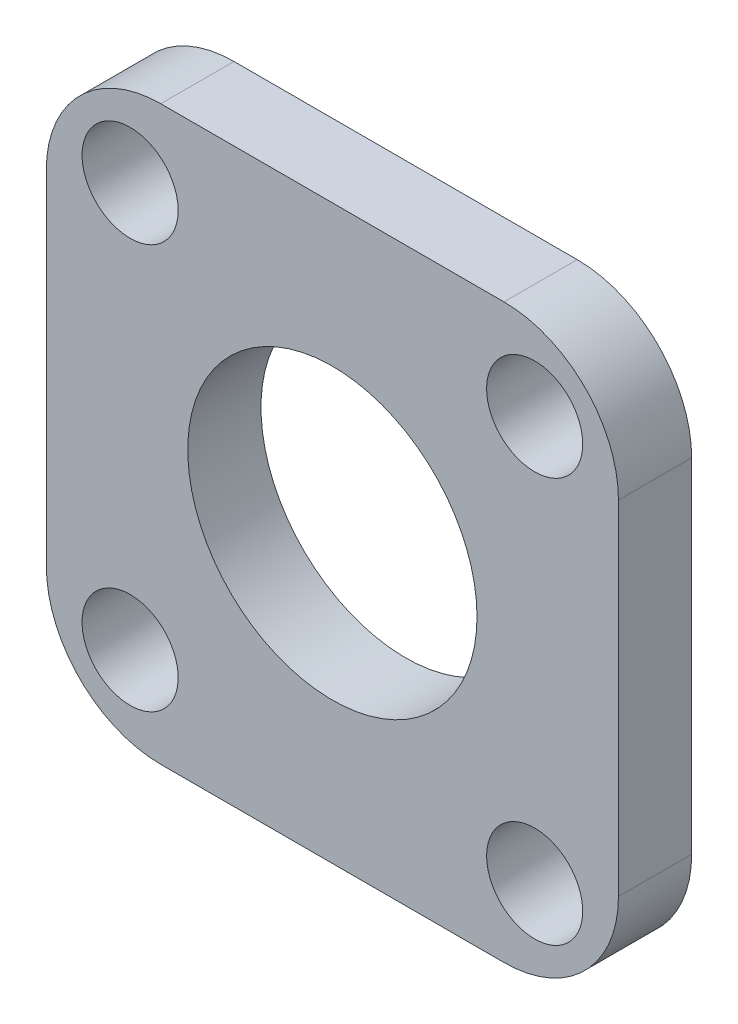
ISO-10303-21;
HEADER;
FILE_DESCRIPTION(('STEP AP214'),'2;1');
FILE_NAME('part.step','',(''),(''),'','','');
FILE_SCHEMA(('AUTOMOTIVE_DESIGN { 1 0 10303 214 1 1 1 1 }'));
ENDSEC;
DATA;
#1=APPLICATION_CONTEXT('core data for automotive mechanical design processes');
#2=APPLICATION_PROTOCOL_DEFINITION('international standard','automotive_design',2000,#1);
#3=PRODUCT_CONTEXT('',#1,'mechanical');
#4=PRODUCT('Part','Part','',(#3));
#5=PRODUCT_RELATED_PRODUCT_CATEGORY('part','',(#4));
#6=PRODUCT_DEFINITION_FORMATION('','',#4);
#7=PRODUCT_DEFINITION_CONTEXT('part definition',#1,'design');
#8=PRODUCT_DEFINITION('design','',#6,#7);
#9=PRODUCT_DEFINITION_SHAPE('','',#8);
#10=(LENGTH_UNIT() NAMED_UNIT(*) SI_UNIT(.MILLI.,.METRE.));
#11=(NAMED_UNIT(*) PLANE_ANGLE_UNIT() SI_UNIT($,.RADIAN.));
#12=(NAMED_UNIT(*) SI_UNIT($,.STERADIAN.) SOLID_ANGLE_UNIT());
#13=UNCERTAINTY_MEASURE_WITH_UNIT(LENGTH_MEASURE(1.E-05),#10,'distance_accuracy_value','');
#14=(GEOMETRIC_REPRESENTATION_CONTEXT(3) GLOBAL_UNCERTAINTY_ASSIGNED_CONTEXT((#13)) GLOBAL_UNIT_ASSIGNED_CONTEXT((#10,
#11,#12)) REPRESENTATION_CONTEXT('',''));
#15=CARTESIAN_POINT('',(0.,0.,0.));
#16=DIRECTION('',(0.,0.,1.));
#17=DIRECTION('',(1.,0.,0.));
#18=AXIS2_PLACEMENT_3D('',#15,#16,#17);
#19=CARTESIAN_POINT('',(12.5,12.5,3.2));
#20=DIRECTION('',(-1.,0.,0.));
#21=DIRECTION('',(0.,-1.,0.));
#22=AXIS2_PLACEMENT_3D('',#19,#20,#21);
#23=PLANE('',#22);
#24=DIRECTION('',(0.,1.,0.));
#25=VECTOR('',#24,1.);
#26=CARTESIAN_POINT('',(12.5,12.5,3.2));
#27=LINE('',#26,#25);
#28=CARTESIAN_POINT('',(12.5,-7.5,3.2));
#29=VERTEX_POINT('',#28);
#30=CARTESIAN_POINT('',(12.5,7.5,3.2));
#31=VERTEX_POINT('',#30);
#32=EDGE_CURVE('E127',#29,#31,#27,.T.);
#33=ORIENTED_EDGE('',*,*,#32,.F.);
#34=DIRECTION('',(0.,0.,-1.));
#35=VECTOR('',#34,1.);
#36=CARTESIAN_POINT('',(12.5,-7.5,3.2));
#37=LINE('',#36,#35);
#38=CARTESIAN_POINT('',(12.5,-7.5,0.));
#39=VERTEX_POINT('',#38);
#40=EDGE_CURVE('E153',#29,#39,#37,.T.);
#41=ORIENTED_EDGE('',*,*,#40,.T.);
#42=DIRECTION('',(0.,1.,0.));
#43=VECTOR('',#42,1.);
#44=CARTESIAN_POINT('',(12.5,12.5,0.));
#45=LINE('',#44,#43);
#46=CARTESIAN_POINT('',(12.5,7.5,0.));
#47=VERTEX_POINT('',#46);
#48=EDGE_CURVE('E159',#39,#47,#45,.T.);
#49=ORIENTED_EDGE('',*,*,#48,.T.);
#50=DIRECTION('',(0.,0.,-1.));
#51=VECTOR('',#50,1.);
#52=CARTESIAN_POINT('',(12.5,7.5,3.2));
#53=LINE('',#52,#51);
#54=EDGE_CURVE('E151',#47,#31,#53,.F.);
#55=ORIENTED_EDGE('',*,*,#54,.T.);
#56=EDGE_LOOP('',(#33,#41,#49,#55));
#57=FACE_BOUND('',#56,.T.);
#58=ADVANCED_FACE('F35',(#57),#23,.F.);
#59=CARTESIAN_POINT('',(-12.5,12.5,3.2));
#60=DIRECTION('',(0.,-1.,0.));
#61=DIRECTION('',(0.,0.,-1.));
#62=AXIS2_PLACEMENT_3D('',#59,#60,#61);
#63=PLANE('',#62);
#64=DIRECTION('',(-1.,0.,0.));
#65=VECTOR('',#64,1.);
#66=CARTESIAN_POINT('',(-12.5,12.5,3.2));
#67=LINE('',#66,#65);
#68=CARTESIAN_POINT('',(7.5,12.5,3.2));
#69=VERTEX_POINT('',#68);
#70=CARTESIAN_POINT('',(-7.5,12.5,3.2));
#71=VERTEX_POINT('',#70);
#72=EDGE_CURVE('E130',#69,#71,#67,.T.);
#73=ORIENTED_EDGE('',*,*,#72,.F.);
#74=DIRECTION('',(0.,0.,-1.));
#75=VECTOR('',#74,1.);
#76=CARTESIAN_POINT('',(7.5,12.5,3.2));
#77=LINE('',#76,#75);
#78=CARTESIAN_POINT('',(7.5,12.5,0.));
#79=VERTEX_POINT('',#78);
#80=EDGE_CURVE('E11',#69,#79,#77,.T.);
#81=ORIENTED_EDGE('',*,*,#80,.T.);
#82=DIRECTION('',(-1.,0.,0.));
#83=VECTOR('',#82,1.);
#84=CARTESIAN_POINT('',(-12.5,12.5,0.));
#85=LINE('',#84,#83);
#86=CARTESIAN_POINT('',(-7.5,12.5,0.));
#87=VERTEX_POINT('',#86);
#88=EDGE_CURVE('E132',#79,#87,#85,.T.);
#89=ORIENTED_EDGE('',*,*,#88,.T.);
#90=DIRECTION('',(0.,0.,-1.));
#91=VECTOR('',#90,1.);
#92=CARTESIAN_POINT('',(-7.5,12.5,3.2));
#93=LINE('',#92,#91);
#94=EDGE_CURVE('E43',#87,#71,#93,.F.);
#95=ORIENTED_EDGE('',*,*,#94,.T.);
#96=EDGE_LOOP('',(#73,#81,#89,#95));
#97=FACE_BOUND('',#96,.T.);
#98=ADVANCED_FACE('F228',(#97),#63,.F.);
#99=CARTESIAN_POINT('',(-12.5,12.5,3.2));
#100=DIRECTION('',(1.,0.,0.));
#101=DIRECTION('',(0.,1.,0.));
#102=AXIS2_PLACEMENT_3D('',#99,#100,#101);
#103=PLANE('',#102);
#104=DIRECTION('',(0.,-1.,0.));
#105=VECTOR('',#104,1.);
#106=CARTESIAN_POINT('',(-12.5,12.5,0.));
#107=LINE('',#106,#105);
#108=CARTESIAN_POINT('',(-12.5,7.5,0.));
#109=VERTEX_POINT('',#108);
#110=CARTESIAN_POINT('',(-12.5,-7.50000000000001,0.));
#111=VERTEX_POINT('',#110);
#112=EDGE_CURVE('E128',#109,#111,#107,.T.);
#113=ORIENTED_EDGE('',*,*,#112,.T.);
#114=DIRECTION('',(0.,0.,-1.));
#115=VECTOR('',#114,1.);
#116=CARTESIAN_POINT('',(-12.5,-7.50000000000001,3.2));
#117=LINE('',#116,#115);
#118=CARTESIAN_POINT('',(-12.5,-7.50000000000001,3.2));
#119=VERTEX_POINT('',#118);
#120=EDGE_CURVE('E106',#111,#119,#117,.F.);
#121=ORIENTED_EDGE('',*,*,#120,.T.);
#122=DIRECTION('',(0.,-1.,0.));
#123=VECTOR('',#122,1.);
#124=CARTESIAN_POINT('',(-12.5,12.5,3.2));
#125=LINE('',#124,#123);
#126=CARTESIAN_POINT('',(-12.5,7.5,3.2));
#127=VERTEX_POINT('',#126);
#128=EDGE_CURVE('E171',#127,#119,#125,.T.);
#129=ORIENTED_EDGE('',*,*,#128,.F.);
#130=DIRECTION('',(0.,0.,-1.));
#131=VECTOR('',#130,1.);
#132=CARTESIAN_POINT('',(-12.5,7.5,3.2));
#133=LINE('',#132,#131);
#134=EDGE_CURVE('E111',#127,#109,#133,.T.);
#135=ORIENTED_EDGE('',*,*,#134,.T.);
#136=EDGE_LOOP('',(#113,#121,#129,#135));
#137=FACE_BOUND('',#136,.T.);
#138=ADVANCED_FACE('F226',(#137),#103,.F.);
#139=CARTESIAN_POINT('',(-12.5,-12.5,3.2));
#140=DIRECTION('',(0.,1.,0.));
#141=DIRECTION('',(0.,0.,1.));
#142=AXIS2_PLACEMENT_3D('',#139,#140,#141);
#143=PLANE('',#142);
#144=DIRECTION('',(1.,0.,0.));
#145=VECTOR('',#144,1.);
#146=CARTESIAN_POINT('',(-12.5,-12.5,3.2));
#147=LINE('',#146,#145);
#148=CARTESIAN_POINT('',(-7.5,-12.5,3.2));
#149=VERTEX_POINT('',#148);
#150=CARTESIAN_POINT('',(7.5,-12.5,3.2));
#151=VERTEX_POINT('',#150);
#152=EDGE_CURVE('E121',#149,#151,#147,.T.);
#153=ORIENTED_EDGE('',*,*,#152,.F.);
#154=DIRECTION('',(0.,0.,-1.));
#155=VECTOR('',#154,1.);
#156=CARTESIAN_POINT('',(-7.5,-12.5,3.2));
#157=LINE('',#156,#155);
#158=CARTESIAN_POINT('',(-7.5,-12.5,0.));
#159=VERTEX_POINT('',#158);
#160=EDGE_CURVE('E105',#149,#159,#157,.T.);
#161=ORIENTED_EDGE('',*,*,#160,.T.);
#162=DIRECTION('',(1.,0.,0.));
#163=VECTOR('',#162,1.);
#164=CARTESIAN_POINT('',(-12.5,-12.5,0.));
#165=LINE('',#164,#163);
#166=CARTESIAN_POINT('',(7.5,-12.5,0.));
#167=VERTEX_POINT('',#166);
#168=EDGE_CURVE('E118',#159,#167,#165,.T.);
#169=ORIENTED_EDGE('',*,*,#168,.T.);
#170=DIRECTION('',(0.,0.,-1.));
#171=VECTOR('',#170,1.);
#172=CARTESIAN_POINT('',(7.5,-12.5,3.2));
#173=LINE('',#172,#171);
#174=EDGE_CURVE('E123',#167,#151,#173,.F.);
#175=ORIENTED_EDGE('',*,*,#174,.T.);
#176=EDGE_LOOP('',(#153,#161,#169,#175));
#177=FACE_BOUND('',#176,.T.);
#178=ADVANCED_FACE('F117',(#177),#143,.F.);
#179=CARTESIAN_POINT('',(0.,0.,3.2));
#180=DIRECTION('',(0.,0.,1.));
#181=DIRECTION('',(1.,0.,0.));
#182=AXIS2_PLACEMENT_3D('',#179,#180,#181);
#183=PLANE('',#182);
#184=CARTESIAN_POINT('',(8.83883476483175,8.83883476483194,3.2));
#185=DIRECTION('',(0.,0.,1.));
#186=DIRECTION('',(0.,-1.,0.));
#187=AXIS2_PLACEMENT_3D('',#184,#185,#186);
#188=CIRCLE('',#187,2.1);
#189=CARTESIAN_POINT('',(8.83883476483177,6.73883476483194,3.2));
#190=VERTEX_POINT('',#189);
#191=EDGE_CURVE('E196',#190,#190,#188,.T.);
#192=ORIENTED_EDGE('',*,*,#191,.F.);
#193=EDGE_LOOP('',(#192));
#194=FACE_BOUND('',#193,.T.);
#195=CARTESIAN_POINT('',(8.83883476483185,-8.83883476483184,3.2));
#196=DIRECTION('',(0.,0.,1.));
#197=DIRECTION('',(-1.,0.,0.));
#198=AXIS2_PLACEMENT_3D('',#195,#196,#197);
#199=CIRCLE('',#198,2.1);
#200=CARTESIAN_POINT('',(6.73883476483185,-8.83883476483184,3.2));
#201=VERTEX_POINT('',#200);
#202=EDGE_CURVE('E190',#201,#201,#199,.T.);
#203=ORIENTED_EDGE('',*,*,#202,.F.);
#204=EDGE_LOOP('',(#203));
#205=FACE_BOUND('',#204,.T.);
#206=CARTESIAN_POINT('',(-8.83883476483181,-8.83883476483188,3.2));
#207=DIRECTION('',(0.,0.,1.));
#208=DIRECTION('',(0.,1.,0.));
#209=AXIS2_PLACEMENT_3D('',#206,#207,#208);
#210=CIRCLE('',#209,2.1);
#211=CARTESIAN_POINT('',(-8.83883476483182,-6.73883476483188,3.2));
#212=VERTEX_POINT('',#211);
#213=EDGE_CURVE('E184',#212,#212,#210,.T.);
#214=ORIENTED_EDGE('',*,*,#213,.F.);
#215=EDGE_LOOP('',(#214));
#216=FACE_BOUND('',#215,.T.);
#217=CARTESIAN_POINT('',(-8.83883476483185,8.83883476483184,3.2));
#218=DIRECTION('',(0.,0.,1.));
#219=DIRECTION('',(1.,0.,0.));
#220=AXIS2_PLACEMENT_3D('',#217,#218,#219);
#221=CIRCLE('',#220,2.1);
#222=CARTESIAN_POINT('',(-6.73883476483185,8.83883476483184,3.2));
#223=VERTEX_POINT('',#222);
#224=EDGE_CURVE('E178',#223,#223,#221,.T.);
#225=ORIENTED_EDGE('',*,*,#224,.F.);
#226=EDGE_LOOP('',(#225));
#227=FACE_BOUND('',#226,.T.);
#228=CARTESIAN_POINT('',(0.,0.,3.2));
#229=DIRECTION('',(0.,0.,1.));
#230=DIRECTION('',(1.,0.,0.));
#231=AXIS2_PLACEMENT_3D('',#228,#229,#230);
#232=CIRCLE('',#231,6.32);
#233=CARTESIAN_POINT('',(6.32,0.,3.2));
#234=VERTEX_POINT('',#233);
#235=EDGE_CURVE('E167',#234,#234,#232,.T.);
#236=ORIENTED_EDGE('',*,*,#235,.F.);
#237=EDGE_LOOP('',(#236));
#238=FACE_BOUND('',#237,.T.);
#239=ORIENTED_EDGE('',*,*,#128,.T.);
#240=CARTESIAN_POINT('',(-7.5,-7.5,3.2));
#241=DIRECTION('',(0.,0.,1.));
#242=DIRECTION('',(1.,0.,0.));
#243=AXIS2_PLACEMENT_3D('',#240,#241,#242);
#244=CIRCLE('',#243,5.);
#245=EDGE_CURVE('E149',#119,#149,#244,.T.);
#246=ORIENTED_EDGE('',*,*,#245,.T.);
#247=ORIENTED_EDGE('',*,*,#152,.T.);
#248=CARTESIAN_POINT('',(7.5,-7.5,3.2));
#249=DIRECTION('',(0.,0.,1.));
#250=DIRECTION('',(1.,0.,0.));
#251=AXIS2_PLACEMENT_3D('',#248,#249,#250);
#252=CIRCLE('',#251,5.);
#253=EDGE_CURVE('E147',#151,#29,#252,.T.);
#254=ORIENTED_EDGE('',*,*,#253,.T.);
#255=ORIENTED_EDGE('',*,*,#32,.T.);
#256=CARTESIAN_POINT('',(7.5,7.5,3.2));
#257=DIRECTION('',(0.,0.,1.));
#258=DIRECTION('',(1.,0.,0.));
#259=AXIS2_PLACEMENT_3D('',#256,#257,#258);
#260=CIRCLE('',#259,5.);
#261=EDGE_CURVE('E56',#31,#69,#260,.T.);
#262=ORIENTED_EDGE('',*,*,#261,.T.);
#263=ORIENTED_EDGE('',*,*,#72,.T.);
#264=CARTESIAN_POINT('',(-7.5,7.5,3.2));
#265=DIRECTION('',(0.,0.,1.));
#266=DIRECTION('',(1.,0.,0.));
#267=AXIS2_PLACEMENT_3D('',#264,#265,#266);
#268=CIRCLE('',#267,5.);
#269=EDGE_CURVE('E144',#71,#127,#268,.T.);
#270=ORIENTED_EDGE('',*,*,#269,.T.);
#271=EDGE_LOOP('',(#239,#246,#247,#254,#255,#262,#263,#270));
#272=FACE_BOUND('',#271,.T.);
#273=ADVANCED_FACE('F211',(#194,#205,#216,#227,#238,#272),#183,.T.);
#274=CARTESIAN_POINT('',(0.,0.,0.));
#275=DIRECTION('',(0.,0.,1.));
#276=DIRECTION('',(1.,0.,0.));
#277=AXIS2_PLACEMENT_3D('',#274,#275,#276);
#278=PLANE('',#277);
#279=CARTESIAN_POINT('',(8.83883476483175,8.83883476483194,0.));
#280=DIRECTION('',(0.,0.,1.));
#281=DIRECTION('',(0.,-1.,0.));
#282=AXIS2_PLACEMENT_3D('',#279,#280,#281);
#283=CIRCLE('',#282,2.1);
#284=CARTESIAN_POINT('',(8.83883476483177,6.73883476483194,0.));
#285=VERTEX_POINT('',#284);
#286=EDGE_CURVE('E193',#285,#285,#283,.T.);
#287=ORIENTED_EDGE('',*,*,#286,.T.);
#288=EDGE_LOOP('',(#287));
#289=FACE_BOUND('',#288,.T.);
#290=CARTESIAN_POINT('',(8.83883476483185,-8.83883476483184,0.));
#291=DIRECTION('',(0.,0.,1.));
#292=DIRECTION('',(-1.,0.,0.));
#293=AXIS2_PLACEMENT_3D('',#290,#291,#292);
#294=CIRCLE('',#293,2.1);
#295=CARTESIAN_POINT('',(6.73883476483185,-8.83883476483184,0.));
#296=VERTEX_POINT('',#295);
#297=EDGE_CURVE('E187',#296,#296,#294,.T.);
#298=ORIENTED_EDGE('',*,*,#297,.T.);
#299=EDGE_LOOP('',(#298));
#300=FACE_BOUND('',#299,.T.);
#301=CARTESIAN_POINT('',(-8.83883476483181,-8.83883476483188,0.));
#302=DIRECTION('',(0.,0.,1.));
#303=DIRECTION('',(0.,1.,0.));
#304=AXIS2_PLACEMENT_3D('',#301,#302,#303);
#305=CIRCLE('',#304,2.1);
#306=CARTESIAN_POINT('',(-8.83883476483182,-6.73883476483188,0.));
#307=VERTEX_POINT('',#306);
#308=EDGE_CURVE('E181',#307,#307,#305,.T.);
#309=ORIENTED_EDGE('',*,*,#308,.T.);
#310=EDGE_LOOP('',(#309));
#311=FACE_BOUND('',#310,.T.);
#312=CARTESIAN_POINT('',(-8.83883476483185,8.83883476483184,0.));
#313=DIRECTION('',(0.,0.,1.));
#314=DIRECTION('',(1.,0.,0.));
#315=AXIS2_PLACEMENT_3D('',#312,#313,#314);
#316=CIRCLE('',#315,2.1);
#317=CARTESIAN_POINT('',(-6.73883476483185,8.83883476483184,0.));
#318=VERTEX_POINT('',#317);
#319=EDGE_CURVE('E177',#318,#318,#316,.T.);
#320=ORIENTED_EDGE('',*,*,#319,.T.);
#321=EDGE_LOOP('',(#320));
#322=FACE_BOUND('',#321,.T.);
#323=CARTESIAN_POINT('',(0.,0.,0.));
#324=DIRECTION('',(0.,0.,1.));
#325=DIRECTION('',(1.,0.,0.));
#326=AXIS2_PLACEMENT_3D('',#323,#324,#325);
#327=CIRCLE('',#326,6.32);
#328=CARTESIAN_POINT('',(6.32,0.,0.));
#329=VERTEX_POINT('',#328);
#330=EDGE_CURVE('E164',#329,#329,#327,.F.);
#331=ORIENTED_EDGE('',*,*,#330,.F.);
#332=EDGE_LOOP('',(#331));
#333=FACE_BOUND('',#332,.T.);
#334=ORIENTED_EDGE('',*,*,#168,.F.);
#335=CARTESIAN_POINT('',(-7.5,-7.5,0.));
#336=DIRECTION('',(0.,0.,1.));
#337=DIRECTION('',(1.,0.,0.));
#338=AXIS2_PLACEMENT_3D('',#335,#336,#337);
#339=CIRCLE('',#338,5.);
#340=EDGE_CURVE('E101',#159,#111,#339,.F.);
#341=ORIENTED_EDGE('',*,*,#340,.T.);
#342=ORIENTED_EDGE('',*,*,#112,.F.);
#343=CARTESIAN_POINT('',(-7.5,7.5,0.));
#344=DIRECTION('',(0.,0.,1.));
#345=DIRECTION('',(1.,0.,0.));
#346=AXIS2_PLACEMENT_3D('',#343,#344,#345);
#347=CIRCLE('',#346,5.);
#348=EDGE_CURVE('E122',#109,#87,#347,.F.);
#349=ORIENTED_EDGE('',*,*,#348,.T.);
#350=ORIENTED_EDGE('',*,*,#88,.F.);
#351=CARTESIAN_POINT('',(7.5,7.5,0.));
#352=DIRECTION('',(0.,0.,1.));
#353=DIRECTION('',(1.,0.,0.));
#354=AXIS2_PLACEMENT_3D('',#351,#352,#353);
#355=CIRCLE('',#354,5.);
#356=EDGE_CURVE('E138',#79,#47,#355,.F.);
#357=ORIENTED_EDGE('',*,*,#356,.T.);
#358=ORIENTED_EDGE('',*,*,#48,.F.);
#359=CARTESIAN_POINT('',(7.5,-7.5,0.));
#360=DIRECTION('',(0.,0.,1.));
#361=DIRECTION('',(1.,0.,0.));
#362=AXIS2_PLACEMENT_3D('',#359,#360,#361);
#363=CIRCLE('',#362,5.);
#364=EDGE_CURVE('E112',#39,#167,#363,.F.);
#365=ORIENTED_EDGE('',*,*,#364,.T.);
#366=EDGE_LOOP('',(#334,#341,#342,#349,#350,#357,#358,#365));
#367=FACE_BOUND('',#366,.T.);
#368=ADVANCED_FACE('F125',(#289,#300,#311,#322,#333,#367),#278,.F.);
#369=CARTESIAN_POINT('',(0.,0.,-0.00100000000000013));
#370=DIRECTION('',(0.,0.,1.));
#371=DIRECTION('',(1.,0.,0.));
#372=AXIS2_PLACEMENT_3D('',#369,#370,#371);
#373=CYLINDRICAL_SURFACE('',#372,6.32);
#374=ORIENTED_EDGE('',*,*,#235,.T.);
#375=EDGE_LOOP('',(#374));
#376=FACE_BOUND('',#375,.T.);
#377=ORIENTED_EDGE('',*,*,#330,.T.);
#378=EDGE_LOOP('',(#377));
#379=FACE_BOUND('',#378,.T.);
#380=ADVANCED_FACE('F252',(#376,#379),#373,.F.);
#381=CARTESIAN_POINT('',(-8.83883476483185,8.83883476483184,0.));
#382=DIRECTION('',(0.,0.,1.));
#383=DIRECTION('',(1.,0.,0.));
#384=AXIS2_PLACEMENT_3D('',#381,#382,#383);
#385=CYLINDRICAL_SURFACE('',#384,2.1);
#386=ORIENTED_EDGE('',*,*,#319,.F.);
#387=EDGE_LOOP('',(#386));
#388=FACE_BOUND('',#387,.T.);
#389=ORIENTED_EDGE('',*,*,#224,.T.);
#390=EDGE_LOOP('',(#389));
#391=FACE_BOUND('',#390,.T.);
#392=ADVANCED_FACE('F256',(#388,#391),#385,.F.);
#393=CARTESIAN_POINT('',(-8.83883476483181,-8.83883476483188,0.));
#394=DIRECTION('',(0.,0.,1.));
#395=DIRECTION('',(1.,0.,0.));
#396=AXIS2_PLACEMENT_3D('',#393,#394,#395);
#397=CYLINDRICAL_SURFACE('',#396,2.1);
#398=ORIENTED_EDGE('',*,*,#308,.F.);
#399=EDGE_LOOP('',(#398));
#400=FACE_BOUND('',#399,.T.);
#401=ORIENTED_EDGE('',*,*,#213,.T.);
#402=EDGE_LOOP('',(#401));
#403=FACE_BOUND('',#402,.T.);
#404=ADVANCED_FACE('F260',(#400,#403),#397,.F.);
#405=CARTESIAN_POINT('',(8.83883476483185,-8.83883476483184,0.));
#406=DIRECTION('',(0.,0.,1.));
#407=DIRECTION('',(1.,0.,0.));
#408=AXIS2_PLACEMENT_3D('',#405,#406,#407);
#409=CYLINDRICAL_SURFACE('',#408,2.1);
#410=ORIENTED_EDGE('',*,*,#297,.F.);
#411=EDGE_LOOP('',(#410));
#412=FACE_BOUND('',#411,.T.);
#413=ORIENTED_EDGE('',*,*,#202,.T.);
#414=EDGE_LOOP('',(#413));
#415=FACE_BOUND('',#414,.T.);
#416=ADVANCED_FACE('F207',(#412,#415),#409,.F.);
#417=CARTESIAN_POINT('',(8.83883476483175,8.83883476483194,0.));
#418=DIRECTION('',(0.,0.,1.));
#419=DIRECTION('',(1.,0.,0.));
#420=AXIS2_PLACEMENT_3D('',#417,#418,#419);
#421=CYLINDRICAL_SURFACE('',#420,2.1);
#422=ORIENTED_EDGE('',*,*,#286,.F.);
#423=EDGE_LOOP('',(#422));
#424=FACE_BOUND('',#423,.T.);
#425=ORIENTED_EDGE('',*,*,#191,.T.);
#426=EDGE_LOOP('',(#425));
#427=FACE_BOUND('',#426,.T.);
#428=ADVANCED_FACE('F204',(#424,#427),#421,.F.);
#429=CARTESIAN_POINT('',(-7.5,-7.5,3.2));
#430=DIRECTION('',(0.,0.,-1.));
#431=DIRECTION('',(-1.,0.,0.));
#432=AXIS2_PLACEMENT_3D('',#429,#430,#431);
#433=CYLINDRICAL_SURFACE('',#432,5.);
#434=ORIENTED_EDGE('',*,*,#245,.F.);
#435=ORIENTED_EDGE('',*,*,#120,.F.);
#436=ORIENTED_EDGE('',*,*,#340,.F.);
#437=ORIENTED_EDGE('',*,*,#160,.F.);
#438=EDGE_LOOP('',(#434,#435,#436,#437));
#439=FACE_BOUND('',#438,.T.);
#440=ADVANCED_FACE('F104',(#439),#433,.T.);
#441=CARTESIAN_POINT('',(7.5,-7.5,3.2));
#442=DIRECTION('',(0.,0.,-1.));
#443=DIRECTION('',(-1.,0.,0.));
#444=AXIS2_PLACEMENT_3D('',#441,#442,#443);
#445=CYLINDRICAL_SURFACE('',#444,5.);
#446=ORIENTED_EDGE('',*,*,#253,.F.);
#447=ORIENTED_EDGE('',*,*,#174,.F.);
#448=ORIENTED_EDGE('',*,*,#364,.F.);
#449=ORIENTED_EDGE('',*,*,#40,.F.);
#450=EDGE_LOOP('',(#446,#447,#448,#449));
#451=FACE_BOUND('',#450,.T.);
#452=ADVANCED_FACE('F232',(#451),#445,.T.);
#453=CARTESIAN_POINT('',(7.5,7.5,3.2));
#454=DIRECTION('',(0.,0.,-1.));
#455=DIRECTION('',(-1.,0.,0.));
#456=AXIS2_PLACEMENT_3D('',#453,#454,#455);
#457=CYLINDRICAL_SURFACE('',#456,5.);
#458=ORIENTED_EDGE('',*,*,#261,.F.);
#459=ORIENTED_EDGE('',*,*,#54,.F.);
#460=ORIENTED_EDGE('',*,*,#356,.F.);
#461=ORIENTED_EDGE('',*,*,#80,.F.);
#462=EDGE_LOOP('',(#458,#459,#460,#461));
#463=FACE_BOUND('',#462,.T.);
#464=ADVANCED_FACE('F231',(#463),#457,.T.);
#465=CARTESIAN_POINT('',(-7.5,7.5,3.2));
#466=DIRECTION('',(0.,0.,-1.));
#467=DIRECTION('',(-1.,0.,0.));
#468=AXIS2_PLACEMENT_3D('',#465,#466,#467);
#469=CYLINDRICAL_SURFACE('',#468,5.);
#470=ORIENTED_EDGE('',*,*,#269,.F.);
#471=ORIENTED_EDGE('',*,*,#94,.F.);
#472=ORIENTED_EDGE('',*,*,#348,.F.);
#473=ORIENTED_EDGE('',*,*,#134,.F.);
#474=EDGE_LOOP('',(#470,#471,#472,#473));
#475=FACE_BOUND('',#474,.T.);
#476=ADVANCED_FACE('F37',(#475),#469,.T.);
#477=CLOSED_SHELL('',(#58,#98,#138,#178,#273,#368,#380,#392,#404,#416,#428,#440,#452,#464,#476));
#478=MANIFOLD_SOLID_BREP('B2',#477);
#479=ADVANCED_BREP_SHAPE_REPRESENTATION('',(#18,#478),#14);
#480=SHAPE_DEFINITION_REPRESENTATION(#9,#479);
ENDSEC;
END-ISO-10303-21;
